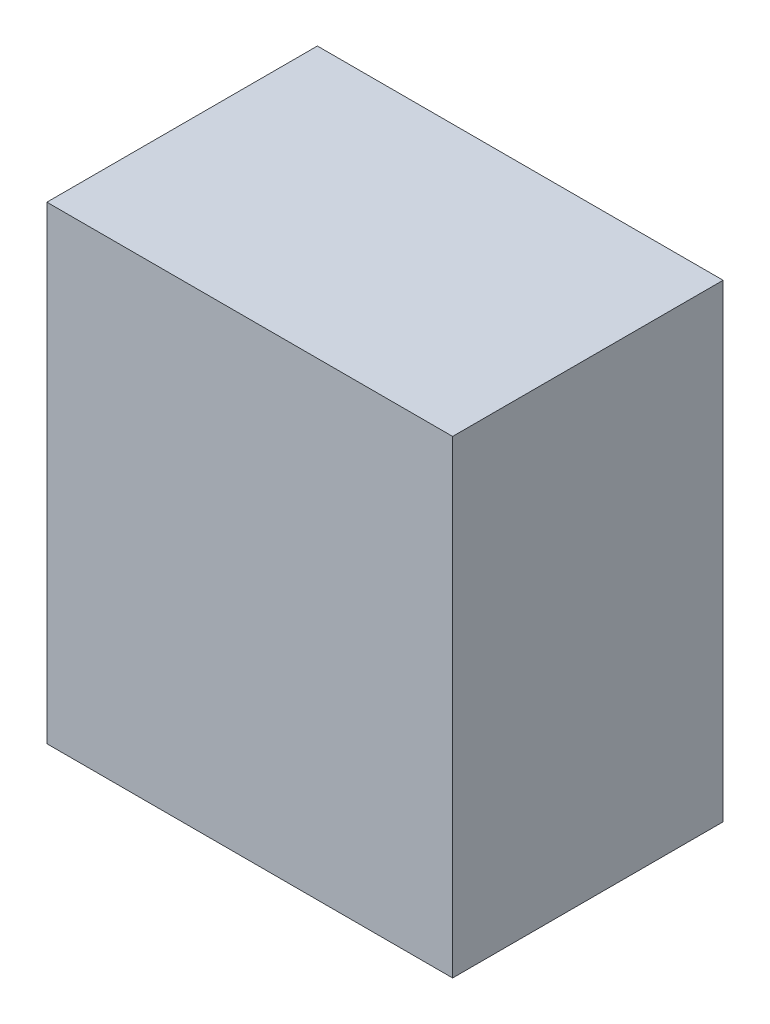
ISO-10303-21;
HEADER;
FILE_DESCRIPTION(('STEP AP214'),'2;1');
FILE_NAME('part.step','',(''),(''),'','','');
FILE_SCHEMA(('AUTOMOTIVE_DESIGN { 1 0 10303 214 1 1 1 1 }'));
ENDSEC;
DATA;
#1=APPLICATION_CONTEXT('core data for automotive mechanical design processes');
#2=APPLICATION_PROTOCOL_DEFINITION('international standard','automotive_design',2000,#1);
#3=PRODUCT_CONTEXT('',#1,'mechanical');
#4=PRODUCT('Part','Part','',(#3));
#5=PRODUCT_RELATED_PRODUCT_CATEGORY('part','',(#4));
#6=PRODUCT_DEFINITION_FORMATION('','',#4);
#7=PRODUCT_DEFINITION_CONTEXT('part definition',#1,'design');
#8=PRODUCT_DEFINITION('design','',#6,#7);
#9=PRODUCT_DEFINITION_SHAPE('','',#8);
#10=(LENGTH_UNIT() NAMED_UNIT(*) SI_UNIT(.MILLI.,.METRE.));
#11=(NAMED_UNIT(*) PLANE_ANGLE_UNIT() SI_UNIT($,.RADIAN.));
#12=(NAMED_UNIT(*) SI_UNIT($,.STERADIAN.) SOLID_ANGLE_UNIT());
#13=UNCERTAINTY_MEASURE_WITH_UNIT(LENGTH_MEASURE(1.E-05),#10,'distance_accuracy_value','');
#14=(GEOMETRIC_REPRESENTATION_CONTEXT(3) GLOBAL_UNCERTAINTY_ASSIGNED_CONTEXT((#13)) GLOBAL_UNIT_ASSIGNED_CONTEXT((#10,
#11,#12)) REPRESENTATION_CONTEXT('',''));
#15=CARTESIAN_POINT('',(0.,0.,0.));
#16=DIRECTION('',(0.,0.,1.));
#17=DIRECTION('',(1.,0.,0.));
#18=AXIS2_PLACEMENT_3D('',#15,#16,#17);
#19=CARTESIAN_POINT('',(375.,-60.,250.));
#20=DIRECTION('',(1.,0.,0.));
#21=DIRECTION('',(0.,0.,-1.));
#22=AXIS2_PLACEMENT_3D('',#19,#20,#21);
#23=PLANE('',#22);
#24=DIRECTION('',(0.,1.,0.));
#25=VECTOR('',#24,1.);
#26=CARTESIAN_POINT('',(375.,-60.,-250.));
#27=LINE('',#26,#25);
#28=CARTESIAN_POINT('',(375.,-60.,-250.));
#29=VERTEX_POINT('',#28);
#30=CARTESIAN_POINT('',(375.,807.000000000002,-250.));
#31=VERTEX_POINT('',#30);
#32=EDGE_CURVE('E40',#29,#31,#27,.T.);
#33=ORIENTED_EDGE('',*,*,#32,.T.);
#34=DIRECTION('',(0.,0.,-1.));
#35=VECTOR('',#34,1.);
#36=CARTESIAN_POINT('',(375.,807.000000000002,250.));
#37=LINE('',#36,#35);
#38=CARTESIAN_POINT('',(375.,807.000000000002,250.));
#39=VERTEX_POINT('',#38);
#40=EDGE_CURVE('E77',#39,#31,#37,.T.);
#41=ORIENTED_EDGE('',*,*,#40,.F.);
#42=DIRECTION('',(0.,1.,0.));
#43=VECTOR('',#42,1.);
#44=CARTESIAN_POINT('',(375.,-60.,250.));
#45=LINE('',#44,#43);
#46=CARTESIAN_POINT('',(375.,-60.,250.));
#47=VERTEX_POINT('',#46);
#48=EDGE_CURVE('E11',#47,#39,#45,.T.);
#49=ORIENTED_EDGE('',*,*,#48,.F.);
#50=DIRECTION('',(0.,0.,-1.));
#51=VECTOR('',#50,1.);
#52=CARTESIAN_POINT('',(375.,-60.,250.));
#53=LINE('',#52,#51);
#54=EDGE_CURVE('E78',#47,#29,#53,.T.);
#55=ORIENTED_EDGE('',*,*,#54,.T.);
#56=EDGE_LOOP('',(#33,#41,#49,#55));
#57=FACE_BOUND('',#56,.T.);
#58=ADVANCED_FACE('F37',(#57),#23,.T.);
#59=CARTESIAN_POINT('',(-375.,-60.,250.));
#60=DIRECTION('',(0.,0.,1.));
#61=DIRECTION('',(1.,0.,0.));
#62=AXIS2_PLACEMENT_3D('',#59,#60,#61);
#63=PLANE('',#62);
#64=ORIENTED_EDGE('',*,*,#48,.T.);
#65=DIRECTION('',(1.,0.,0.));
#66=VECTOR('',#65,1.);
#67=CARTESIAN_POINT('',(-375.,807.000000000002,250.));
#68=LINE('',#67,#66);
#69=CARTESIAN_POINT('',(-375.,807.000000000002,250.));
#70=VERTEX_POINT('',#69);
#71=EDGE_CURVE('E94',#70,#39,#68,.T.);
#72=ORIENTED_EDGE('',*,*,#71,.F.);
#73=DIRECTION('',(0.,1.,0.));
#74=VECTOR('',#73,1.);
#75=CARTESIAN_POINT('',(-375.,-60.,250.));
#76=LINE('',#75,#74);
#77=CARTESIAN_POINT('',(-375.,-60.,250.));
#78=VERTEX_POINT('',#77);
#79=EDGE_CURVE('E45',#78,#70,#76,.T.);
#80=ORIENTED_EDGE('',*,*,#79,.F.);
#81=DIRECTION('',(1.,0.,0.));
#82=VECTOR('',#81,1.);
#83=CARTESIAN_POINT('',(-375.,-60.,250.));
#84=LINE('',#83,#82);
#85=EDGE_CURVE('E83',#78,#47,#84,.T.);
#86=ORIENTED_EDGE('',*,*,#85,.T.);
#87=EDGE_LOOP('',(#64,#72,#80,#86));
#88=FACE_BOUND('',#87,.T.);
#89=ADVANCED_FACE('F109',(#88),#63,.T.);
#90=CARTESIAN_POINT('',(-375.,-60.,250.));
#91=DIRECTION('',(-1.,0.,0.));
#92=DIRECTION('',(0.,0.,1.));
#93=AXIS2_PLACEMENT_3D('',#90,#91,#92);
#94=PLANE('',#93);
#95=ORIENTED_EDGE('',*,*,#79,.T.);
#96=DIRECTION('',(0.,0.,1.));
#97=VECTOR('',#96,1.);
#98=CARTESIAN_POINT('',(-375.,807.000000000002,250.));
#99=LINE('',#98,#97);
#100=CARTESIAN_POINT('',(-375.,807.000000000002,-250.));
#101=VERTEX_POINT('',#100);
#102=EDGE_CURVE('E90',#101,#70,#99,.T.);
#103=ORIENTED_EDGE('',*,*,#102,.F.);
#104=DIRECTION('',(0.,1.,0.));
#105=VECTOR('',#104,1.);
#106=CARTESIAN_POINT('',(-375.,-60.,-250.));
#107=LINE('',#106,#105);
#108=CARTESIAN_POINT('',(-375.,-60.,-250.));
#109=VERTEX_POINT('',#108);
#110=EDGE_CURVE('E82',#109,#101,#107,.T.);
#111=ORIENTED_EDGE('',*,*,#110,.F.);
#112=DIRECTION('',(0.,0.,1.));
#113=VECTOR('',#112,1.);
#114=CARTESIAN_POINT('',(-375.,-60.,250.));
#115=LINE('',#114,#113);
#116=EDGE_CURVE('E102',#109,#78,#115,.T.);
#117=ORIENTED_EDGE('',*,*,#116,.T.);
#118=EDGE_LOOP('',(#95,#103,#111,#117));
#119=FACE_BOUND('',#118,.T.);
#120=ADVANCED_FACE('F106',(#119),#94,.T.);
#121=CARTESIAN_POINT('',(-375.,-60.,-250.));
#122=DIRECTION('',(0.,0.,-1.));
#123=DIRECTION('',(-1.,0.,0.));
#124=AXIS2_PLACEMENT_3D('',#121,#122,#123);
#125=PLANE('',#124);
#126=ORIENTED_EDGE('',*,*,#110,.T.);
#127=DIRECTION('',(-1.,0.,0.));
#128=VECTOR('',#127,1.);
#129=CARTESIAN_POINT('',(-375.,807.000000000002,-250.));
#130=LINE('',#129,#128);
#131=EDGE_CURVE('E85',#31,#101,#130,.T.);
#132=ORIENTED_EDGE('',*,*,#131,.F.);
#133=ORIENTED_EDGE('',*,*,#32,.F.);
#134=DIRECTION('',(-1.,0.,0.));
#135=VECTOR('',#134,1.);
#136=CARTESIAN_POINT('',(-375.,-60.,-250.));
#137=LINE('',#136,#135);
#138=EDGE_CURVE('E100',#29,#109,#137,.T.);
#139=ORIENTED_EDGE('',*,*,#138,.T.);
#140=EDGE_LOOP('',(#126,#132,#133,#139));
#141=FACE_BOUND('',#140,.T.);
#142=ADVANCED_FACE('F86',(#141),#125,.T.);
#143=CARTESIAN_POINT('',(0.,-60.,0.));
#144=DIRECTION('',(0.,-1.,0.));
#145=DIRECTION('',(0.,0.,-1.));
#146=AXIS2_PLACEMENT_3D('',#143,#144,#145);
#147=PLANE('',#146);
#148=ORIENTED_EDGE('',*,*,#54,.F.);
#149=ORIENTED_EDGE('',*,*,#85,.F.);
#150=ORIENTED_EDGE('',*,*,#116,.F.);
#151=ORIENTED_EDGE('',*,*,#138,.F.);
#152=EDGE_LOOP('',(#148,#149,#150,#151));
#153=FACE_BOUND('',#152,.T.);
#154=ADVANCED_FACE('F111',(#153),#147,.T.);
#155=CARTESIAN_POINT('',(0.,807.000000000002,0.));
#156=DIRECTION('',(0.,-1.,0.));
#157=DIRECTION('',(0.,0.,-1.));
#158=AXIS2_PLACEMENT_3D('',#155,#156,#157);
#159=PLANE('',#158);
#160=ORIENTED_EDGE('',*,*,#40,.T.);
#161=ORIENTED_EDGE('',*,*,#131,.T.);
#162=ORIENTED_EDGE('',*,*,#102,.T.);
#163=ORIENTED_EDGE('',*,*,#71,.T.);
#164=EDGE_LOOP('',(#160,#161,#162,#163));
#165=FACE_BOUND('',#164,.T.);
#166=ADVANCED_FACE('F93',(#165),#159,.F.);
#167=CLOSED_SHELL('',(#58,#89,#120,#142,#154,#166));
#168=MANIFOLD_SOLID_BREP('B2',#167);
#169=ADVANCED_BREP_SHAPE_REPRESENTATION('',(#18,#168),#14);
#170=SHAPE_DEFINITION_REPRESENTATION(#9,#169);
ENDSEC;
END-ISO-10303-21;
